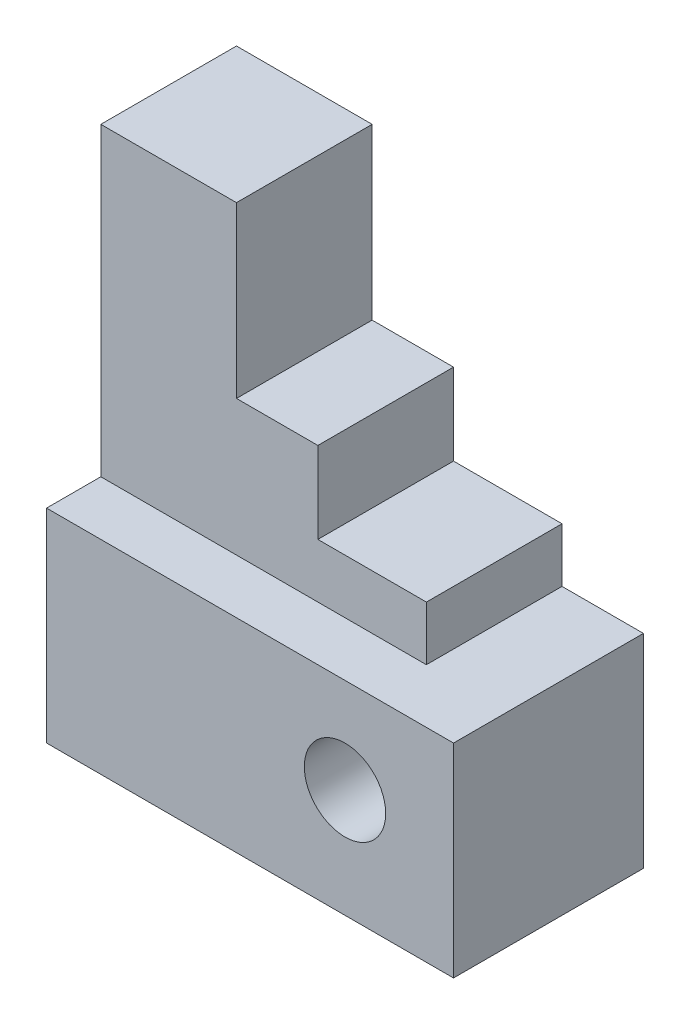
ISO-10303-21;
HEADER;
FILE_DESCRIPTION(('STEP AP214'),'2;1');
FILE_NAME('part.step','',(''),(''),'','','');
FILE_SCHEMA(('AUTOMOTIVE_DESIGN { 1 0 10303 214 1 1 1 1 }'));
ENDSEC;
DATA;
#1=APPLICATION_CONTEXT('core data for automotive mechanical design processes');
#2=APPLICATION_PROTOCOL_DEFINITION('international standard','automotive_design',2000,#1);
#3=PRODUCT_CONTEXT('',#1,'mechanical');
#4=PRODUCT('Part','Part','',(#3));
#5=PRODUCT_RELATED_PRODUCT_CATEGORY('part','',(#4));
#6=PRODUCT_DEFINITION_FORMATION('','',#4);
#7=PRODUCT_DEFINITION_CONTEXT('part definition',#1,'design');
#8=PRODUCT_DEFINITION('design','',#6,#7);
#9=PRODUCT_DEFINITION_SHAPE('','',#8);
#10=(LENGTH_UNIT() NAMED_UNIT(*) SI_UNIT(.MILLI.,.METRE.));
#11=(NAMED_UNIT(*) PLANE_ANGLE_UNIT() SI_UNIT($,.RADIAN.));
#12=(NAMED_UNIT(*) SI_UNIT($,.STERADIAN.) SOLID_ANGLE_UNIT());
#13=UNCERTAINTY_MEASURE_WITH_UNIT(LENGTH_MEASURE(1.E-05),#10,'distance_accuracy_value','');
#14=(GEOMETRIC_REPRESENTATION_CONTEXT(3) GLOBAL_UNCERTAINTY_ASSIGNED_CONTEXT((#13)) GLOBAL_UNIT_ASSIGNED_CONTEXT((#10,
#11,#12)) REPRESENTATION_CONTEXT('',''));
#15=CARTESIAN_POINT('',(0.,0.,0.));
#16=DIRECTION('',(0.,0.,1.));
#17=DIRECTION('',(1.,0.,0.));
#18=AXIS2_PLACEMENT_3D('',#15,#16,#17);
#19=CARTESIAN_POINT('',(0.,0.,28.));
#20=DIRECTION('',(0.,1.,0.));
#21=DIRECTION('',(0.,0.,1.));
#22=AXIS2_PLACEMENT_3D('',#19,#20,#21);
#23=PLANE('',#22);
#24=DIRECTION('',(1.,0.,0.));
#25=VECTOR('',#24,1.);
#26=CARTESIAN_POINT('',(0.,0.,0.));
#27=LINE('',#26,#25);
#28=CARTESIAN_POINT('',(0.,0.,0.));
#29=VERTEX_POINT('',#28);
#30=CARTESIAN_POINT('',(60.,0.,0.));
#31=VERTEX_POINT('',#30);
#32=EDGE_CURVE('E207',#29,#31,#27,.T.);
#33=ORIENTED_EDGE('',*,*,#32,.T.);
#34=DIRECTION('',(0.,0.,-1.));
#35=VECTOR('',#34,1.);
#36=CARTESIAN_POINT('',(60.,0.,28.));
#37=LINE('',#36,#35);
#38=CARTESIAN_POINT('',(60.,0.,28.));
#39=VERTEX_POINT('',#38);
#40=EDGE_CURVE('E11',#39,#31,#37,.T.);
#41=ORIENTED_EDGE('',*,*,#40,.F.);
#42=DIRECTION('',(1.,0.,0.));
#43=VECTOR('',#42,1.);
#44=CARTESIAN_POINT('',(0.,0.,28.));
#45=LINE('',#44,#43);
#46=CARTESIAN_POINT('',(0.,0.,28.));
#47=VERTEX_POINT('',#46);
#48=EDGE_CURVE('E192',#47,#39,#45,.T.);
#49=ORIENTED_EDGE('',*,*,#48,.F.);
#50=DIRECTION('',(0.,0.,-1.));
#51=VECTOR('',#50,1.);
#52=CARTESIAN_POINT('',(0.,0.,28.));
#53=LINE('',#52,#51);
#54=EDGE_CURVE('E204',#47,#29,#53,.T.);
#55=ORIENTED_EDGE('',*,*,#54,.T.);
#56=EDGE_LOOP('',(#33,#41,#49,#55));
#57=FACE_BOUND('',#56,.T.);
#58=ADVANCED_FACE('F41',(#57),#23,.F.);
#59=CARTESIAN_POINT('',(60.,0.,28.));
#60=DIRECTION('',(-1.,0.,0.));
#61=DIRECTION('',(0.,0.,1.));
#62=AXIS2_PLACEMENT_3D('',#59,#60,#61);
#63=PLANE('',#62);
#64=DIRECTION('',(0.,1.,0.));
#65=VECTOR('',#64,1.);
#66=CARTESIAN_POINT('',(60.,0.,0.));
#67=LINE('',#66,#65);
#68=CARTESIAN_POINT('',(60.,30.,0.));
#69=VERTEX_POINT('',#68);
#70=EDGE_CURVE('E210',#31,#69,#67,.T.);
#71=ORIENTED_EDGE('',*,*,#70,.T.);
#72=DIRECTION('',(0.,0.,-1.));
#73=VECTOR('',#72,1.);
#74=CARTESIAN_POINT('',(60.,30.,28.));
#75=LINE('',#74,#73);
#76=CARTESIAN_POINT('',(60.,30.,28.));
#77=VERTEX_POINT('',#76);
#78=EDGE_CURVE('E49',#77,#69,#75,.T.);
#79=ORIENTED_EDGE('',*,*,#78,.F.);
#80=DIRECTION('',(0.,1.,0.));
#81=VECTOR('',#80,1.);
#82=CARTESIAN_POINT('',(60.,0.,28.));
#83=LINE('',#82,#81);
#84=EDGE_CURVE('E196',#39,#77,#83,.T.);
#85=ORIENTED_EDGE('',*,*,#84,.F.);
#86=ORIENTED_EDGE('',*,*,#40,.T.);
#87=EDGE_LOOP('',(#71,#79,#85,#86));
#88=FACE_BOUND('',#87,.T.);
#89=ADVANCED_FACE('F221',(#88),#63,.F.);
#90=CARTESIAN_POINT('',(0.,30.,28.));
#91=DIRECTION('',(0.,1.,0.));
#92=DIRECTION('',(0.,0.,1.));
#93=AXIS2_PLACEMENT_3D('',#90,#91,#92);
#94=PLANE('',#93);
#95=DIRECTION('',(0.,0.,-1.));
#96=VECTOR('',#95,1.);
#97=CARTESIAN_POINT('',(48.,30.,20.));
#98=LINE('',#97,#96);
#99=CARTESIAN_POINT('',(48.,30.,20.));
#100=VERTEX_POINT('',#99);
#101=CARTESIAN_POINT('',(48.,30.,0.));
#102=VERTEX_POINT('',#101);
#103=EDGE_CURVE('E163',#100,#102,#98,.T.);
#104=ORIENTED_EDGE('',*,*,#103,.F.);
#105=DIRECTION('',(1.,0.,0.));
#106=VECTOR('',#105,1.);
#107=CARTESIAN_POINT('',(0.,30.,20.));
#108=LINE('',#107,#106);
#109=CARTESIAN_POINT('',(0.,30.,20.));
#110=VERTEX_POINT('',#109);
#111=EDGE_CURVE('E56',#110,#100,#108,.T.);
#112=ORIENTED_EDGE('',*,*,#111,.F.);
#113=DIRECTION('',(0.,0.,-1.));
#114=VECTOR('',#113,1.);
#115=CARTESIAN_POINT('',(0.,30.,28.));
#116=LINE('',#115,#114);
#117=CARTESIAN_POINT('',(0.,30.,28.));
#118=VERTEX_POINT('',#117);
#119=EDGE_CURVE('E216',#118,#110,#116,.T.);
#120=ORIENTED_EDGE('',*,*,#119,.F.);
#121=DIRECTION('',(1.,0.,0.));
#122=VECTOR('',#121,1.);
#123=CARTESIAN_POINT('',(0.,30.,28.));
#124=LINE('',#123,#122);
#125=EDGE_CURVE('E198',#118,#77,#124,.T.);
#126=ORIENTED_EDGE('',*,*,#125,.T.);
#127=ORIENTED_EDGE('',*,*,#78,.T.);
#128=DIRECTION('',(1.,0.,0.));
#129=VECTOR('',#128,1.);
#130=CARTESIAN_POINT('',(0.,30.,0.));
#131=LINE('',#130,#129);
#132=EDGE_CURVE('E62',#102,#69,#131,.T.);
#133=ORIENTED_EDGE('',*,*,#132,.F.);
#134=EDGE_LOOP('',(#104,#112,#120,#126,#127,#133));
#135=FACE_BOUND('',#134,.T.);
#136=ADVANCED_FACE('F218',(#135),#94,.T.);
#137=CARTESIAN_POINT('',(44.,16.,28.));
#138=DIRECTION('',(0.,0.,-1.));
#139=DIRECTION('',(-1.,0.,0.));
#140=AXIS2_PLACEMENT_3D('',#137,#138,#139);
#141=CYLINDRICAL_SURFACE('',#140,6.);
#142=CARTESIAN_POINT('',(44.,16.,28.));
#143=DIRECTION('',(0.,0.,1.));
#144=DIRECTION('',(1.,0.,0.));
#145=AXIS2_PLACEMENT_3D('',#142,#143,#144);
#146=CIRCLE('',#145,6.);
#147=CARTESIAN_POINT('',(50.,16.,28.));
#148=VERTEX_POINT('',#147);
#149=EDGE_CURVE('E189',#148,#148,#146,.T.);
#150=ORIENTED_EDGE('',*,*,#149,.T.);
#151=EDGE_LOOP('',(#150));
#152=FACE_BOUND('',#151,.T.);
#153=CARTESIAN_POINT('',(44.,16.,0.));
#154=DIRECTION('',(0.,0.,1.));
#155=DIRECTION('',(1.,0.,0.));
#156=AXIS2_PLACEMENT_3D('',#153,#154,#155);
#157=CIRCLE('',#156,6.);
#158=CARTESIAN_POINT('',(50.,16.,0.));
#159=VERTEX_POINT('',#158);
#160=EDGE_CURVE('E133',#159,#159,#157,.T.);
#161=ORIENTED_EDGE('',*,*,#160,.F.);
#162=EDGE_LOOP('',(#161));
#163=FACE_BOUND('',#162,.T.);
#164=ADVANCED_FACE('F43',(#152,#163),#141,.F.);
#165=CARTESIAN_POINT('',(0.,0.,28.));
#166=DIRECTION('',(-1.,0.,0.));
#167=DIRECTION('',(0.,0.,1.));
#168=AXIS2_PLACEMENT_3D('',#165,#166,#167);
#169=PLANE('',#168);
#170=DIRECTION('',(0.,1.,0.));
#171=VECTOR('',#170,1.);
#172=CARTESIAN_POINT('',(0.,0.,0.));
#173=LINE('',#172,#171);
#174=CARTESIAN_POINT('',(0.,75.,0.));
#175=VERTEX_POINT('',#174);
#176=EDGE_CURVE('E193',#29,#175,#173,.T.);
#177=ORIENTED_EDGE('',*,*,#176,.F.);
#178=ORIENTED_EDGE('',*,*,#54,.F.);
#179=DIRECTION('',(0.,1.,0.));
#180=VECTOR('',#179,1.);
#181=CARTESIAN_POINT('',(0.,0.,28.));
#182=LINE('',#181,#180);
#183=EDGE_CURVE('E201',#47,#118,#182,.T.);
#184=ORIENTED_EDGE('',*,*,#183,.T.);
#185=ORIENTED_EDGE('',*,*,#119,.T.);
#186=DIRECTION('',(0.,1.,0.));
#187=VECTOR('',#186,1.);
#188=CARTESIAN_POINT('',(0.,0.,20.));
#189=LINE('',#188,#187);
#190=CARTESIAN_POINT('',(0.,75.,20.));
#191=VERTEX_POINT('',#190);
#192=EDGE_CURVE('E159',#110,#191,#189,.T.);
#193=ORIENTED_EDGE('',*,*,#192,.T.);
#194=DIRECTION('',(0.,0.,-1.));
#195=VECTOR('',#194,1.);
#196=CARTESIAN_POINT('',(0.,75.,20.));
#197=LINE('',#196,#195);
#198=EDGE_CURVE('E179',#191,#175,#197,.T.);
#199=ORIENTED_EDGE('',*,*,#198,.T.);
#200=EDGE_LOOP('',(#177,#178,#184,#185,#193,#199));
#201=FACE_BOUND('',#200,.T.);
#202=ADVANCED_FACE('F243',(#201),#169,.T.);
#203=CARTESIAN_POINT('',(0.,0.,28.));
#204=DIRECTION('',(0.,0.,1.));
#205=DIRECTION('',(1.,0.,0.));
#206=AXIS2_PLACEMENT_3D('',#203,#204,#205);
#207=PLANE('',#206);
#208=ORIENTED_EDGE('',*,*,#149,.F.);
#209=EDGE_LOOP('',(#208));
#210=FACE_BOUND('',#209,.T.);
#211=ORIENTED_EDGE('',*,*,#48,.T.);
#212=ORIENTED_EDGE('',*,*,#84,.T.);
#213=ORIENTED_EDGE('',*,*,#125,.F.);
#214=ORIENTED_EDGE('',*,*,#183,.F.);
#215=EDGE_LOOP('',(#211,#212,#213,#214));
#216=FACE_BOUND('',#215,.T.);
#217=ADVANCED_FACE('F246',(#210,#216),#207,.T.);
#218=CARTESIAN_POINT('',(0.,0.,0.));
#219=DIRECTION('',(0.,0.,1.));
#220=DIRECTION('',(1.,0.,0.));
#221=AXIS2_PLACEMENT_3D('',#218,#219,#220);
#222=PLANE('',#221);
#223=ORIENTED_EDGE('',*,*,#160,.T.);
#224=EDGE_LOOP('',(#223));
#225=FACE_BOUND('',#224,.T.);
#226=ORIENTED_EDGE('',*,*,#32,.F.);
#227=ORIENTED_EDGE('',*,*,#176,.T.);
#228=DIRECTION('',(1.,0.,0.));
#229=VECTOR('',#228,1.);
#230=CARTESIAN_POINT('',(0.,75.,0.));
#231=LINE('',#230,#229);
#232=CARTESIAN_POINT('',(20.,75.,0.));
#233=VERTEX_POINT('',#232);
#234=EDGE_CURVE('E143',#175,#233,#231,.T.);
#235=ORIENTED_EDGE('',*,*,#234,.T.);
#236=DIRECTION('',(0.,-1.,0.));
#237=VECTOR('',#236,1.);
#238=CARTESIAN_POINT('',(20.,0.,0.));
#239=LINE('',#238,#237);
#240=CARTESIAN_POINT('',(20.,50.,0.));
#241=VERTEX_POINT('',#240);
#242=EDGE_CURVE('E173',#233,#241,#239,.T.);
#243=ORIENTED_EDGE('',*,*,#242,.T.);
#244=DIRECTION('',(1.,0.,0.));
#245=VECTOR('',#244,1.);
#246=CARTESIAN_POINT('',(0.,50.,0.));
#247=LINE('',#246,#245);
#248=CARTESIAN_POINT('',(32.,50.,0.));
#249=VERTEX_POINT('',#248);
#250=EDGE_CURVE('E170',#241,#249,#247,.T.);
#251=ORIENTED_EDGE('',*,*,#250,.T.);
#252=DIRECTION('',(0.,-1.,0.));
#253=VECTOR('',#252,1.);
#254=CARTESIAN_POINT('',(32.,0.,0.));
#255=LINE('',#254,#253);
#256=CARTESIAN_POINT('',(32.,38.,0.));
#257=VERTEX_POINT('',#256);
#258=EDGE_CURVE('E167',#249,#257,#255,.T.);
#259=ORIENTED_EDGE('',*,*,#258,.T.);
#260=DIRECTION('',(1.,0.,0.));
#261=VECTOR('',#260,1.);
#262=CARTESIAN_POINT('',(0.,38.,0.));
#263=LINE('',#262,#261);
#264=CARTESIAN_POINT('',(48.,38.,0.));
#265=VERTEX_POINT('',#264);
#266=EDGE_CURVE('E165',#257,#265,#263,.T.);
#267=ORIENTED_EDGE('',*,*,#266,.T.);
#268=DIRECTION('',(0.,-1.,0.));
#269=VECTOR('',#268,1.);
#270=CARTESIAN_POINT('',(48.,0.,0.));
#271=LINE('',#270,#269);
#272=EDGE_CURVE('E128',#265,#102,#271,.T.);
#273=ORIENTED_EDGE('',*,*,#272,.T.);
#274=ORIENTED_EDGE('',*,*,#132,.T.);
#275=ORIENTED_EDGE('',*,*,#70,.F.);
#276=EDGE_LOOP('',(#226,#227,#235,#243,#251,#259,#267,#273,#274,#275));
#277=FACE_BOUND('',#276,.T.);
#278=ADVANCED_FACE('F225',(#225,#277),#222,.F.);
#279=CARTESIAN_POINT('',(48.,0.,20.));
#280=DIRECTION('',(1.,0.,0.));
#281=DIRECTION('',(0.,0.,-1.));
#282=AXIS2_PLACEMENT_3D('',#279,#280,#281);
#283=PLANE('',#282);
#284=ORIENTED_EDGE('',*,*,#272,.F.);
#285=DIRECTION('',(0.,0.,-1.));
#286=VECTOR('',#285,1.);
#287=CARTESIAN_POINT('',(48.,38.,20.));
#288=LINE('',#287,#286);
#289=CARTESIAN_POINT('',(48.,38.,20.));
#290=VERTEX_POINT('',#289);
#291=EDGE_CURVE('E123',#290,#265,#288,.T.);
#292=ORIENTED_EDGE('',*,*,#291,.F.);
#293=DIRECTION('',(0.,-1.,0.));
#294=VECTOR('',#293,1.);
#295=CARTESIAN_POINT('',(48.,0.,20.));
#296=LINE('',#295,#294);
#297=EDGE_CURVE('E126',#290,#100,#296,.T.);
#298=ORIENTED_EDGE('',*,*,#297,.T.);
#299=ORIENTED_EDGE('',*,*,#103,.T.);
#300=EDGE_LOOP('',(#284,#292,#298,#299));
#301=FACE_BOUND('',#300,.T.);
#302=ADVANCED_FACE('F125',(#301),#283,.T.);
#303=CARTESIAN_POINT('',(0.,38.,20.));
#304=DIRECTION('',(0.,1.,0.));
#305=DIRECTION('',(0.,0.,1.));
#306=AXIS2_PLACEMENT_3D('',#303,#304,#305);
#307=PLANE('',#306);
#308=ORIENTED_EDGE('',*,*,#266,.F.);
#309=DIRECTION('',(0.,0.,-1.));
#310=VECTOR('',#309,1.);
#311=CARTESIAN_POINT('',(32.,38.,20.));
#312=LINE('',#311,#310);
#313=CARTESIAN_POINT('',(32.,38.,20.));
#314=VERTEX_POINT('',#313);
#315=EDGE_CURVE('E134',#314,#257,#312,.T.);
#316=ORIENTED_EDGE('',*,*,#315,.F.);
#317=DIRECTION('',(1.,0.,0.));
#318=VECTOR('',#317,1.);
#319=CARTESIAN_POINT('',(0.,38.,20.));
#320=LINE('',#319,#318);
#321=EDGE_CURVE('E140',#314,#290,#320,.T.);
#322=ORIENTED_EDGE('',*,*,#321,.T.);
#323=ORIENTED_EDGE('',*,*,#291,.T.);
#324=EDGE_LOOP('',(#308,#316,#322,#323));
#325=FACE_BOUND('',#324,.T.);
#326=ADVANCED_FACE('F145',(#325),#307,.T.);
#327=CARTESIAN_POINT('',(32.,0.,20.));
#328=DIRECTION('',(1.,0.,0.));
#329=DIRECTION('',(0.,0.,-1.));
#330=AXIS2_PLACEMENT_3D('',#327,#328,#329);
#331=PLANE('',#330);
#332=ORIENTED_EDGE('',*,*,#258,.F.);
#333=DIRECTION('',(0.,0.,-1.));
#334=VECTOR('',#333,1.);
#335=CARTESIAN_POINT('',(32.,50.,20.));
#336=LINE('',#335,#334);
#337=CARTESIAN_POINT('',(32.,50.,20.));
#338=VERTEX_POINT('',#337);
#339=EDGE_CURVE('E186',#338,#249,#336,.T.);
#340=ORIENTED_EDGE('',*,*,#339,.F.);
#341=DIRECTION('',(0.,-1.,0.));
#342=VECTOR('',#341,1.);
#343=CARTESIAN_POINT('',(32.,0.,20.));
#344=LINE('',#343,#342);
#345=EDGE_CURVE('E146',#338,#314,#344,.T.);
#346=ORIENTED_EDGE('',*,*,#345,.T.);
#347=ORIENTED_EDGE('',*,*,#315,.T.);
#348=EDGE_LOOP('',(#332,#340,#346,#347));
#349=FACE_BOUND('',#348,.T.);
#350=ADVANCED_FACE('F230',(#349),#331,.T.);
#351=CARTESIAN_POINT('',(0.,50.,20.));
#352=DIRECTION('',(0.,1.,0.));
#353=DIRECTION('',(0.,0.,1.));
#354=AXIS2_PLACEMENT_3D('',#351,#352,#353);
#355=PLANE('',#354);
#356=ORIENTED_EDGE('',*,*,#250,.F.);
#357=DIRECTION('',(0.,0.,-1.));
#358=VECTOR('',#357,1.);
#359=CARTESIAN_POINT('',(20.,50.,20.));
#360=LINE('',#359,#358);
#361=CARTESIAN_POINT('',(20.,50.,20.));
#362=VERTEX_POINT('',#361);
#363=EDGE_CURVE('E184',#362,#241,#360,.T.);
#364=ORIENTED_EDGE('',*,*,#363,.F.);
#365=DIRECTION('',(1.,0.,0.));
#366=VECTOR('',#365,1.);
#367=CARTESIAN_POINT('',(0.,50.,20.));
#368=LINE('',#367,#366);
#369=EDGE_CURVE('E148',#362,#338,#368,.T.);
#370=ORIENTED_EDGE('',*,*,#369,.T.);
#371=ORIENTED_EDGE('',*,*,#339,.T.);
#372=EDGE_LOOP('',(#356,#364,#370,#371));
#373=FACE_BOUND('',#372,.T.);
#374=ADVANCED_FACE('F234',(#373),#355,.T.);
#375=CARTESIAN_POINT('',(20.,0.,20.));
#376=DIRECTION('',(1.,0.,0.));
#377=DIRECTION('',(0.,1.,0.));
#378=AXIS2_PLACEMENT_3D('',#375,#376,#377);
#379=PLANE('',#378);
#380=ORIENTED_EDGE('',*,*,#242,.F.);
#381=DIRECTION('',(0.,0.,-1.));
#382=VECTOR('',#381,1.);
#383=CARTESIAN_POINT('',(20.,75.,20.));
#384=LINE('',#383,#382);
#385=CARTESIAN_POINT('',(20.,75.,20.));
#386=VERTEX_POINT('',#385);
#387=EDGE_CURVE('E182',#386,#233,#384,.T.);
#388=ORIENTED_EDGE('',*,*,#387,.F.);
#389=DIRECTION('',(0.,-1.,0.));
#390=VECTOR('',#389,1.);
#391=CARTESIAN_POINT('',(20.,0.,20.));
#392=LINE('',#391,#390);
#393=EDGE_CURVE('E153',#386,#362,#392,.T.);
#394=ORIENTED_EDGE('',*,*,#393,.T.);
#395=ORIENTED_EDGE('',*,*,#363,.T.);
#396=EDGE_LOOP('',(#380,#388,#394,#395));
#397=FACE_BOUND('',#396,.T.);
#398=ADVANCED_FACE('F237',(#397),#379,.T.);
#399=CARTESIAN_POINT('',(0.,75.,20.));
#400=DIRECTION('',(0.,1.,0.));
#401=DIRECTION('',(0.,0.,1.));
#402=AXIS2_PLACEMENT_3D('',#399,#400,#401);
#403=PLANE('',#402);
#404=ORIENTED_EDGE('',*,*,#234,.F.);
#405=ORIENTED_EDGE('',*,*,#198,.F.);
#406=DIRECTION('',(1.,0.,0.));
#407=VECTOR('',#406,1.);
#408=CARTESIAN_POINT('',(0.,75.,20.));
#409=LINE('',#408,#407);
#410=EDGE_CURVE('E156',#191,#386,#409,.T.);
#411=ORIENTED_EDGE('',*,*,#410,.T.);
#412=ORIENTED_EDGE('',*,*,#387,.T.);
#413=EDGE_LOOP('',(#404,#405,#411,#412));
#414=FACE_BOUND('',#413,.T.);
#415=ADVANCED_FACE('F241',(#414),#403,.T.);
#416=CARTESIAN_POINT('',(0.,0.,20.));
#417=DIRECTION('',(0.,0.,1.));
#418=DIRECTION('',(1.,0.,0.));
#419=AXIS2_PLACEMENT_3D('',#416,#417,#418);
#420=PLANE('',#419);
#421=ORIENTED_EDGE('',*,*,#297,.F.);
#422=ORIENTED_EDGE('',*,*,#321,.F.);
#423=ORIENTED_EDGE('',*,*,#345,.F.);
#424=ORIENTED_EDGE('',*,*,#369,.F.);
#425=ORIENTED_EDGE('',*,*,#393,.F.);
#426=ORIENTED_EDGE('',*,*,#410,.F.);
#427=ORIENTED_EDGE('',*,*,#192,.F.);
#428=ORIENTED_EDGE('',*,*,#111,.T.);
#429=EDGE_LOOP('',(#421,#422,#423,#424,#425,#426,#427,#428));
#430=FACE_BOUND('',#429,.T.);
#431=ADVANCED_FACE('F138',(#430),#420,.T.);
#432=CLOSED_SHELL('',(#58,#89,#136,#164,#202,#217,#278,#302,#326,#350,#374,#398,#415,#431));
#433=MANIFOLD_SOLID_BREP('B2',#432);
#434=ADVANCED_BREP_SHAPE_REPRESENTATION('',(#18,#433),#14);
#435=SHAPE_DEFINITION_REPRESENTATION(#9,#434);
ENDSEC;
END-ISO-10303-21;
